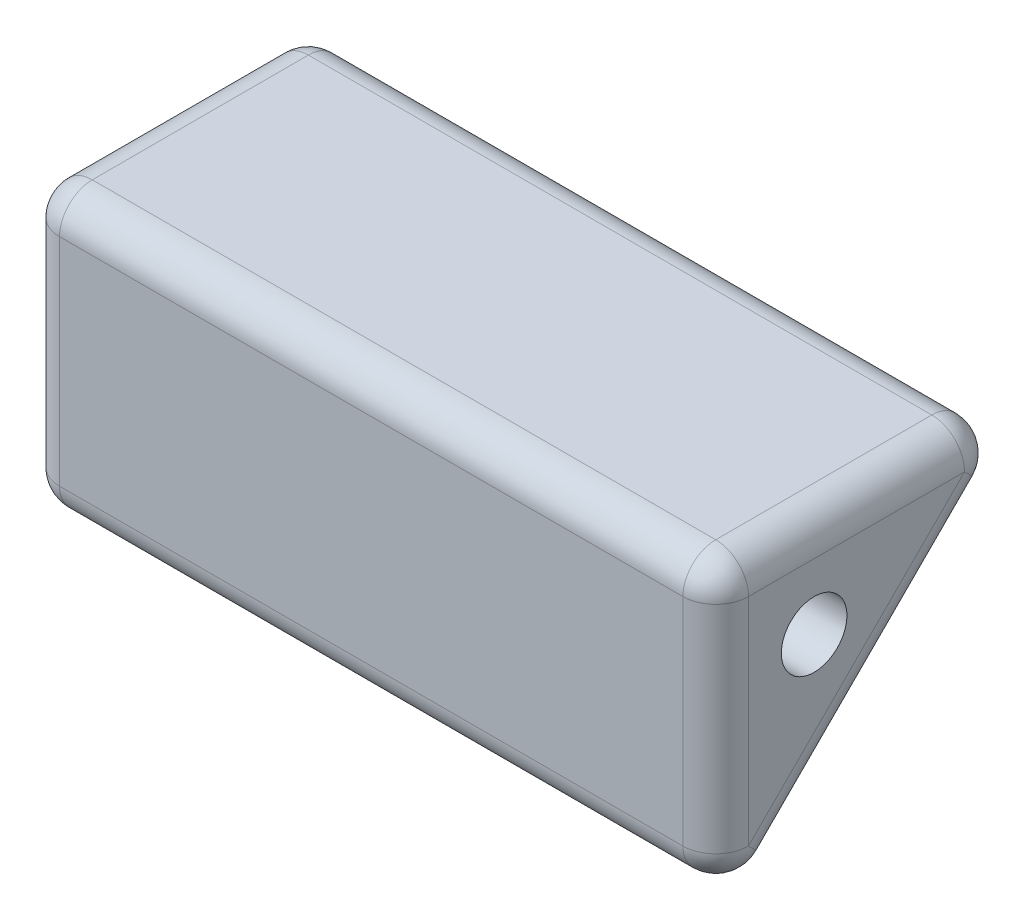
ISO-10303-21;
HEADER;
FILE_DESCRIPTION(('STEP AP214'),'2;1');
FILE_NAME('part.step','',(''),(''),'','','');
FILE_SCHEMA(('AUTOMOTIVE_DESIGN { 1 0 10303 214 1 1 1 1 }'));
ENDSEC;
DATA;
#1=APPLICATION_CONTEXT('core data for automotive mechanical design processes');
#2=APPLICATION_PROTOCOL_DEFINITION('international standard','automotive_design',2000,#1);
#3=PRODUCT_CONTEXT('',#1,'mechanical');
#4=PRODUCT('Part','Part','',(#3));
#5=PRODUCT_RELATED_PRODUCT_CATEGORY('part','',(#4));
#6=PRODUCT_DEFINITION_FORMATION('','',#4);
#7=PRODUCT_DEFINITION_CONTEXT('part definition',#1,'design');
#8=PRODUCT_DEFINITION('design','',#6,#7);
#9=PRODUCT_DEFINITION_SHAPE('','',#8);
#10=(LENGTH_UNIT() NAMED_UNIT(*) SI_UNIT(.MILLI.,.METRE.));
#11=(NAMED_UNIT(*) PLANE_ANGLE_UNIT() SI_UNIT($,.RADIAN.));
#12=(NAMED_UNIT(*) SI_UNIT($,.STERADIAN.) SOLID_ANGLE_UNIT());
#13=UNCERTAINTY_MEASURE_WITH_UNIT(LENGTH_MEASURE(1.E-05),#10,'distance_accuracy_value','');
#14=(GEOMETRIC_REPRESENTATION_CONTEXT(3) GLOBAL_UNCERTAINTY_ASSIGNED_CONTEXT((#13)) GLOBAL_UNIT_ASSIGNED_CONTEXT((#10,
#11,#12)) REPRESENTATION_CONTEXT('',''));
#15=CARTESIAN_POINT('',(0.,0.,0.));
#16=DIRECTION('',(0.,0.,1.));
#17=DIRECTION('',(1.,0.,0.));
#18=AXIS2_PLACEMENT_3D('',#15,#16,#17);
#19=CARTESIAN_POINT('',(21.,0.,0.));
#20=DIRECTION('',(0.,1.,0.));
#21=DIRECTION('',(0.,0.,1.));
#22=AXIS2_PLACEMENT_3D('',#19,#20,#21);
#23=PLANE('',#22);
#24=DIRECTION('',(0.,0.,-1.));
#25=VECTOR('',#24,1.);
#26=CARTESIAN_POINT('',(1.,0.,0.));
#27=LINE('',#26,#25);
#28=CARTESIAN_POINT('',(1.,0.,-7.58578643762691));
#29=VERTEX_POINT('',#28);
#30=CARTESIAN_POINT('',(1.,0.,-1.));
#31=VERTEX_POINT('',#30);
#32=EDGE_CURVE('E147',#29,#31,#27,.F.);
#33=ORIENTED_EDGE('',*,*,#32,.T.);
#34=DIRECTION('',(-1.,0.,0.));
#35=VECTOR('',#34,1.);
#36=CARTESIAN_POINT('',(21.,0.,-1.));
#37=LINE('',#36,#35);
#38=CARTESIAN_POINT('',(20.,0.,-1.));
#39=VERTEX_POINT('',#38);
#40=EDGE_CURVE('E151',#31,#39,#37,.F.);
#41=ORIENTED_EDGE('',*,*,#40,.T.);
#42=DIRECTION('',(0.,0.,-1.));
#43=VECTOR('',#42,1.);
#44=CARTESIAN_POINT('',(20.,0.,0.));
#45=LINE('',#44,#43);
#46=CARTESIAN_POINT('',(20.,0.,-7.58578643762691));
#47=VERTEX_POINT('',#46);
#48=EDGE_CURVE('E121',#39,#47,#45,.T.);
#49=ORIENTED_EDGE('',*,*,#48,.T.);
#50=DIRECTION('',(-1.,0.,0.));
#51=VECTOR('',#50,1.);
#52=CARTESIAN_POINT('',(21.,0.,-7.58578643762691));
#53=LINE('',#52,#51);
#54=EDGE_CURVE('E140',#47,#29,#53,.T.);
#55=ORIENTED_EDGE('',*,*,#54,.T.);
#56=EDGE_LOOP('',(#33,#41,#49,#55));
#57=FACE_BOUND('',#56,.T.);
#58=ADVANCED_FACE('F45',(#57),#23,.T.);
#59=CARTESIAN_POINT('',(21.,0.,0.));
#60=DIRECTION('',(0.,0.,-1.));
#61=DIRECTION('',(0.,1.,0.));
#62=AXIS2_PLACEMENT_3D('',#59,#60,#61);
#63=PLANE('',#62);
#64=DIRECTION('',(0.,-1.,0.));
#65=VECTOR('',#64,1.);
#66=CARTESIAN_POINT('',(20.,0.,0.));
#67=LINE('',#66,#65);
#68=CARTESIAN_POINT('',(20.,-7.5857864376269,0.));
#69=VERTEX_POINT('',#68);
#70=CARTESIAN_POINT('',(20.,-1.,0.));
#71=VERTEX_POINT('',#70);
#72=EDGE_CURVE('E184',#69,#71,#67,.F.);
#73=ORIENTED_EDGE('',*,*,#72,.T.);
#74=DIRECTION('',(-1.,0.,0.));
#75=VECTOR('',#74,1.);
#76=CARTESIAN_POINT('',(0.,-1.,0.));
#77=LINE('',#76,#75);
#78=CARTESIAN_POINT('',(1.,-1.,0.));
#79=VERTEX_POINT('',#78);
#80=EDGE_CURVE('E187',#71,#79,#77,.T.);
#81=ORIENTED_EDGE('',*,*,#80,.T.);
#82=DIRECTION('',(0.,-1.,0.));
#83=VECTOR('',#82,1.);
#84=CARTESIAN_POINT('',(1.,0.,0.));
#85=LINE('',#84,#83);
#86=CARTESIAN_POINT('',(1.,-7.5857864376269,0.));
#87=VERTEX_POINT('',#86);
#88=EDGE_CURVE('E181',#79,#87,#85,.T.);
#89=ORIENTED_EDGE('',*,*,#88,.T.);
#90=DIRECTION('',(-1.,0.,0.));
#91=VECTOR('',#90,1.);
#92=CARTESIAN_POINT('',(21.,-7.5857864376269,0.));
#93=LINE('',#92,#91);
#94=EDGE_CURVE('E178',#87,#69,#93,.F.);
#95=ORIENTED_EDGE('',*,*,#94,.T.);
#96=EDGE_LOOP('',(#73,#81,#89,#95));
#97=FACE_BOUND('',#96,.T.);
#98=ADVANCED_FACE('F284',(#97),#63,.F.);
#99=CARTESIAN_POINT('',(21.,-5.,-5.));
#100=DIRECTION('',(0.,-0.707106781186547,-0.707106781186547));
#101=DIRECTION('',(0.,0.707106781186548,-0.707106781186548));
#102=AXIS2_PLACEMENT_3D('',#99,#100,#101);
#103=PLANE('',#102);
#104=DIRECTION('',(0.,-0.707106781186548,0.707106781186548));
#105=VECTOR('',#104,1.);
#106=CARTESIAN_POINT('',(20.,-5.,-5.));
#107=LINE('',#106,#105);
#108=CARTESIAN_POINT('',(20.,-1.70710678118655,-8.29289321881345));
#109=VERTEX_POINT('',#108);
#110=CARTESIAN_POINT('',(20.,-8.29289321881345,-1.70710678118655));
#111=VERTEX_POINT('',#110);
#112=EDGE_CURVE('E55',#109,#111,#107,.T.);
#113=ORIENTED_EDGE('',*,*,#112,.T.);
#114=DIRECTION('',(-1.,0.,0.));
#115=VECTOR('',#114,1.);
#116=CARTESIAN_POINT('',(0.,-8.29289321881345,-1.70710678118655));
#117=LINE('',#116,#115);
#118=CARTESIAN_POINT('',(1.,-8.29289321881345,-1.70710678118655));
#119=VERTEX_POINT('',#118);
#120=EDGE_CURVE('E11',#111,#119,#117,.T.);
#121=ORIENTED_EDGE('',*,*,#120,.T.);
#122=DIRECTION('',(0.,-0.707106781186548,0.707106781186548));
#123=VECTOR('',#122,1.);
#124=CARTESIAN_POINT('',(1.,0.,-10.));
#125=LINE('',#124,#123);
#126=CARTESIAN_POINT('',(1.,-1.70710678118655,-8.29289321881345));
#127=VERTEX_POINT('',#126);
#128=EDGE_CURVE('E191',#119,#127,#125,.F.);
#129=ORIENTED_EDGE('',*,*,#128,.T.);
#130=DIRECTION('',(-1.,0.,0.));
#131=VECTOR('',#130,1.);
#132=CARTESIAN_POINT('',(21.,-1.70710678118655,-8.29289321881345));
#133=LINE('',#132,#131);
#134=EDGE_CURVE('E66',#127,#109,#133,.F.);
#135=ORIENTED_EDGE('',*,*,#134,.T.);
#136=EDGE_LOOP('',(#113,#121,#129,#135));
#137=FACE_BOUND('',#136,.T.);
#138=ADVANCED_FACE('F289',(#137),#103,.T.);
#139=CARTESIAN_POINT('',(21.,0.,0.));
#140=DIRECTION('',(1.,0.,0.));
#141=DIRECTION('',(0.,0.,-1.));
#142=AXIS2_PLACEMENT_3D('',#139,#140,#141);
#143=PLANE('',#142);
#144=DIRECTION('',(0.,-0.707106781186548,0.707106781186548));
#145=VECTOR('',#144,1.);
#146=CARTESIAN_POINT('',(21.,-4.29289321881345,-4.29289321881345));
#147=LINE('',#146,#145);
#148=CARTESIAN_POINT('',(21.,-7.5857864376269,-1.));
#149=VERTEX_POINT('',#148);
#150=CARTESIAN_POINT('',(21.,-1.,-7.58578643762691));
#151=VERTEX_POINT('',#150);
#152=EDGE_CURVE('E157',#149,#151,#147,.F.);
#153=ORIENTED_EDGE('',*,*,#152,.T.);
#154=DIRECTION('',(0.,0.,-1.));
#155=VECTOR('',#154,1.);
#156=CARTESIAN_POINT('',(21.,-1.,0.));
#157=LINE('',#156,#155);
#158=CARTESIAN_POINT('',(21.,-1.,-1.));
#159=VERTEX_POINT('',#158);
#160=EDGE_CURVE('E123',#151,#159,#157,.F.);
#161=ORIENTED_EDGE('',*,*,#160,.T.);
#162=DIRECTION('',(0.,-1.,0.));
#163=VECTOR('',#162,1.);
#164=CARTESIAN_POINT('',(21.,-10.,-1.));
#165=LINE('',#164,#163);
#166=EDGE_CURVE('E163',#159,#149,#165,.T.);
#167=ORIENTED_EDGE('',*,*,#166,.T.);
#168=EDGE_LOOP('',(#153,#161,#167));
#169=FACE_BOUND('',#168,.T.);
#170=CARTESIAN_POINT('',(21.,-3.,-3.));
#171=DIRECTION('',(-1.,0.,0.));
#172=DIRECTION('',(0.,0.,1.));
#173=AXIS2_PLACEMENT_3D('',#170,#171,#172);
#174=CIRCLE('',#173,1.);
#175=CARTESIAN_POINT('',(21.,-3.,-2.));
#176=VERTEX_POINT('',#175);
#177=EDGE_CURVE('E148',#176,#176,#174,.T.);
#178=ORIENTED_EDGE('',*,*,#177,.T.);
#179=EDGE_LOOP('',(#178));
#180=FACE_BOUND('',#179,.T.);
#181=ADVANCED_FACE('F268',(#169,#180),#143,.T.);
#182=CARTESIAN_POINT('',(0.,0.,0.));
#183=DIRECTION('',(1.,0.,0.));
#184=DIRECTION('',(0.,0.,-1.));
#185=AXIS2_PLACEMENT_3D('',#182,#183,#184);
#186=PLANE('',#185);
#187=DIRECTION('',(0.,-1.,0.));
#188=VECTOR('',#187,1.);
#189=CARTESIAN_POINT('',(0.,0.,-1.));
#190=LINE('',#189,#188);
#191=CARTESIAN_POINT('',(0.,-7.58578643762691,-1.));
#192=VERTEX_POINT('',#191);
#193=CARTESIAN_POINT('',(0.,-1.,-1.));
#194=VERTEX_POINT('',#193);
#195=EDGE_CURVE('E171',#192,#194,#190,.F.);
#196=ORIENTED_EDGE('',*,*,#195,.T.);
#197=DIRECTION('',(0.,0.,-1.));
#198=VECTOR('',#197,1.);
#199=CARTESIAN_POINT('',(0.,-1.,-10.));
#200=LINE('',#199,#198);
#201=CARTESIAN_POINT('',(0.,-1.,-7.58578643762691));
#202=VERTEX_POINT('',#201);
#203=EDGE_CURVE('E174',#194,#202,#200,.T.);
#204=ORIENTED_EDGE('',*,*,#203,.T.);
#205=DIRECTION('',(0.,-0.707106781186548,0.707106781186548));
#206=VECTOR('',#205,1.);
#207=CARTESIAN_POINT('',(0.,-9.29289321881345,0.707106781186548));
#208=LINE('',#207,#206);
#209=EDGE_CURVE('E168',#202,#192,#208,.T.);
#210=ORIENTED_EDGE('',*,*,#209,.T.);
#211=EDGE_LOOP('',(#196,#204,#210));
#212=FACE_BOUND('',#211,.T.);
#213=CARTESIAN_POINT('',(0.,-3.,-3.));
#214=DIRECTION('',(-1.,0.,0.));
#215=DIRECTION('',(0.,0.,1.));
#216=AXIS2_PLACEMENT_3D('',#213,#214,#215);
#217=CIRCLE('',#216,1.);
#218=CARTESIAN_POINT('',(0.,-3.,-2.));
#219=VERTEX_POINT('',#218);
#220=EDGE_CURVE('E253',#219,#219,#217,.T.);
#221=ORIENTED_EDGE('',*,*,#220,.F.);
#222=EDGE_LOOP('',(#221));
#223=FACE_BOUND('',#222,.T.);
#224=ADVANCED_FACE('F272',(#212,#223),#186,.F.);
#225=CARTESIAN_POINT('',(21.,-3.,-3.));
#226=DIRECTION('',(-1.,0.,0.));
#227=DIRECTION('',(0.,0.,1.));
#228=AXIS2_PLACEMENT_3D('',#225,#226,#227);
#229=CYLINDRICAL_SURFACE('',#228,1.);
#230=ORIENTED_EDGE('',*,*,#177,.F.);
#231=EDGE_LOOP('',(#230));
#232=FACE_BOUND('',#231,.T.);
#233=ORIENTED_EDGE('',*,*,#220,.T.);
#234=EDGE_LOOP('',(#233));
#235=FACE_BOUND('',#234,.T.);
#236=ADVANCED_FACE('F270',(#232,#235),#229,.F.);
#237=CARTESIAN_POINT('',(1.,-7.5857864376269,-1.));
#238=DIRECTION('',(-1.,0.,0.));
#239=DIRECTION('',(0.,-1.,0.));
#240=AXIS2_PLACEMENT_3D('',#237,#238,#239);
#241=SPHERICAL_SURFACE('',#240,1.);
#242=CARTESIAN_POINT('',(1.,-7.5857864376269,-1.));
#243=DIRECTION('',(-1.,0.,0.));
#244=DIRECTION('',(0.,0.,1.));
#245=AXIS2_PLACEMENT_3D('',#242,#243,#244);
#246=CIRCLE('',#245,1.);
#247=EDGE_CURVE('E241',#87,#119,#246,.F.);
#248=ORIENTED_EDGE('',*,*,#247,.F.);
#249=CARTESIAN_POINT('',(1.,-7.5857864376269,-1.));
#250=DIRECTION('',(0.,-1.,0.));
#251=DIRECTION('',(1.,0.,0.));
#252=AXIS2_PLACEMENT_3D('',#249,#250,#251);
#253=CIRCLE('',#252,1.);
#254=EDGE_CURVE('E49',#192,#87,#253,.F.);
#255=ORIENTED_EDGE('',*,*,#254,.F.);
#256=CARTESIAN_POINT('',(1.,-7.58578643762691,-1.));
#257=DIRECTION('',(0.,-0.707106781186549,0.707106781186546));
#258=DIRECTION('',(0.,-0.707106781186546,-0.707106781186549));
#259=AXIS2_PLACEMENT_3D('',#256,#257,#258);
#260=CIRCLE('',#259,1.);
#261=EDGE_CURVE('E244',#119,#192,#260,.F.);
#262=ORIENTED_EDGE('',*,*,#261,.F.);
#263=EDGE_LOOP('',(#248,#255,#262));
#264=FACE_BOUND('',#263,.T.);
#265=ADVANCED_FACE('F47',(#264),#241,.T.);
#266=CARTESIAN_POINT('',(1.,0.,-1.));
#267=DIRECTION('',(0.,-1.,0.));
#268=DIRECTION('',(0.,0.,-1.));
#269=AXIS2_PLACEMENT_3D('',#266,#267,#268);
#270=CYLINDRICAL_SURFACE('',#269,1.);
#271=ORIENTED_EDGE('',*,*,#254,.T.);
#272=ORIENTED_EDGE('',*,*,#88,.F.);
#273=CARTESIAN_POINT('',(1.,-1.,-1.));
#274=DIRECTION('',(0.,1.,0.));
#275=DIRECTION('',(0.,0.,1.));
#276=AXIS2_PLACEMENT_3D('',#273,#274,#275);
#277=CIRCLE('',#276,1.);
#278=EDGE_CURVE('E237',#194,#79,#277,.T.);
#279=ORIENTED_EDGE('',*,*,#278,.F.);
#280=ORIENTED_EDGE('',*,*,#195,.F.);
#281=EDGE_LOOP('',(#271,#272,#279,#280));
#282=FACE_BOUND('',#281,.T.);
#283=ADVANCED_FACE('F278',(#282),#270,.T.);
#284=CARTESIAN_POINT('',(1.,-1.,0.));
#285=DIRECTION('',(0.,0.,1.));
#286=DIRECTION('',(1.,0.,0.));
#287=AXIS2_PLACEMENT_3D('',#284,#285,#286);
#288=CYLINDRICAL_SURFACE('',#287,1.);
#289=CARTESIAN_POINT('',(1.,-1.,-7.58578643762691));
#290=DIRECTION('',(0.,0.,-1.));
#291=DIRECTION('',(0.,1.,0.));
#292=AXIS2_PLACEMENT_3D('',#289,#290,#291);
#293=CIRCLE('',#292,1.);
#294=EDGE_CURVE('E229',#202,#29,#293,.T.);
#295=ORIENTED_EDGE('',*,*,#294,.F.);
#296=ORIENTED_EDGE('',*,*,#203,.F.);
#297=CARTESIAN_POINT('',(1.,-1.,-1.));
#298=DIRECTION('',(0.,0.,1.));
#299=DIRECTION('',(1.,0.,0.));
#300=AXIS2_PLACEMENT_3D('',#297,#298,#299);
#301=CIRCLE('',#300,1.);
#302=EDGE_CURVE('E233',#31,#194,#301,.T.);
#303=ORIENTED_EDGE('',*,*,#302,.F.);
#304=ORIENTED_EDGE('',*,*,#32,.F.);
#305=EDGE_LOOP('',(#295,#296,#303,#304));
#306=FACE_BOUND('',#305,.T.);
#307=ADVANCED_FACE('F335',(#306),#288,.T.);
#308=CARTESIAN_POINT('',(1.,-4.29289321881345,-4.29289321881345));
#309=DIRECTION('',(0.,0.707106781186548,-0.707106781186548));
#310=DIRECTION('',(0.,0.707106781186548,0.707106781186548));
#311=AXIS2_PLACEMENT_3D('',#308,#309,#310);
#312=CYLINDRICAL_SURFACE('',#311,1.);
#313=ORIENTED_EDGE('',*,*,#261,.T.);
#314=ORIENTED_EDGE('',*,*,#209,.F.);
#315=CARTESIAN_POINT('',(1.,-1.,-7.58578643762691));
#316=DIRECTION('',(0.,0.707106781186548,-0.707106781186548));
#317=DIRECTION('',(0.,0.707106781186548,0.707106781186548));
#318=AXIS2_PLACEMENT_3D('',#315,#316,#317);
#319=CIRCLE('',#318,1.);
#320=EDGE_CURVE('E226',#127,#202,#319,.T.);
#321=ORIENTED_EDGE('',*,*,#320,.F.);
#322=ORIENTED_EDGE('',*,*,#128,.F.);
#323=EDGE_LOOP('',(#313,#314,#321,#322));
#324=FACE_BOUND('',#323,.T.);
#325=ADVANCED_FACE('F331',(#324),#312,.T.);
#326=CARTESIAN_POINT('',(21.,-7.5857864376269,-1.));
#327=DIRECTION('',(1.,0.,0.));
#328=DIRECTION('',(0.,0.,-1.));
#329=AXIS2_PLACEMENT_3D('',#326,#327,#328);
#330=CYLINDRICAL_SURFACE('',#329,1.);
#331=ORIENTED_EDGE('',*,*,#247,.T.);
#332=ORIENTED_EDGE('',*,*,#120,.F.);
#333=CARTESIAN_POINT('',(20.,-7.5857864376269,-1.));
#334=DIRECTION('',(1.,0.,0.));
#335=DIRECTION('',(0.,0.,-1.));
#336=AXIS2_PLACEMENT_3D('',#333,#334,#335);
#337=CIRCLE('',#336,1.);
#338=EDGE_CURVE('E222',#69,#111,#337,.T.);
#339=ORIENTED_EDGE('',*,*,#338,.F.);
#340=ORIENTED_EDGE('',*,*,#94,.F.);
#341=EDGE_LOOP('',(#331,#332,#339,#340));
#342=FACE_BOUND('',#341,.T.);
#343=ADVANCED_FACE('F327',(#342),#330,.T.);
#344=CARTESIAN_POINT('',(1.,-1.,-1.));
#345=DIRECTION('',(-1.,0.,0.));
#346=DIRECTION('',(0.,0.,1.));
#347=AXIS2_PLACEMENT_3D('',#344,#345,#346);
#348=SPHERICAL_SURFACE('',#347,1.);
#349=ORIENTED_EDGE('',*,*,#302,.T.);
#350=ORIENTED_EDGE('',*,*,#278,.T.);
#351=CARTESIAN_POINT('',(1.,-1.,-1.));
#352=DIRECTION('',(-1.,0.,0.));
#353=DIRECTION('',(0.,-1.,0.));
#354=AXIS2_PLACEMENT_3D('',#351,#352,#353);
#355=CIRCLE('',#354,1.);
#356=EDGE_CURVE('E215',#31,#79,#355,.F.);
#357=ORIENTED_EDGE('',*,*,#356,.F.);
#358=EDGE_LOOP('',(#349,#350,#357));
#359=FACE_BOUND('',#358,.T.);
#360=ADVANCED_FACE('F323',(#359),#348,.T.);
#361=CARTESIAN_POINT('',(1.,-1.,-7.58578643762691));
#362=DIRECTION('',(-1.,0.,0.));
#363=DIRECTION('',(0.,0.,1.));
#364=AXIS2_PLACEMENT_3D('',#361,#362,#363);
#365=SPHERICAL_SURFACE('',#364,1.);
#366=ORIENTED_EDGE('',*,*,#320,.T.);
#367=ORIENTED_EDGE('',*,*,#294,.T.);
#368=CARTESIAN_POINT('',(1.,-1.,-7.58578643762691));
#369=DIRECTION('',(-1.,0.,0.));
#370=DIRECTION('',(0.,0.,1.));
#371=AXIS2_PLACEMENT_3D('',#368,#369,#370);
#372=CIRCLE('',#371,1.);
#373=EDGE_CURVE('E143',#127,#29,#372,.F.);
#374=ORIENTED_EDGE('',*,*,#373,.F.);
#375=EDGE_LOOP('',(#366,#367,#374));
#376=FACE_BOUND('',#375,.T.);
#377=ADVANCED_FACE('F319',(#376),#365,.T.);
#378=CARTESIAN_POINT('',(20.,-7.5857864376269,-1.));
#379=DIRECTION('',(1.,0.,0.));
#380=DIRECTION('',(0.,0.,-1.));
#381=AXIS2_PLACEMENT_3D('',#378,#379,#380);
#382=SPHERICAL_SURFACE('',#381,1.);
#383=CARTESIAN_POINT('',(20.,-7.5857864376269,-1.));
#384=DIRECTION('',(0.,-0.707106781186547,0.707106781186547));
#385=DIRECTION('',(0.,-0.707106781186548,-0.707106781186548));
#386=AXIS2_PLACEMENT_3D('',#383,#384,#385);
#387=CIRCLE('',#386,1.);
#388=EDGE_CURVE('E209',#149,#111,#387,.F.);
#389=ORIENTED_EDGE('',*,*,#388,.F.);
#390=CARTESIAN_POINT('',(20.,-7.5857864376269,-1.));
#391=DIRECTION('',(0.,-1.,0.));
#392=DIRECTION('',(0.,0.,-1.));
#393=AXIS2_PLACEMENT_3D('',#390,#391,#392);
#394=CIRCLE('',#393,1.);
#395=EDGE_CURVE('E218',#69,#149,#394,.F.);
#396=ORIENTED_EDGE('',*,*,#395,.F.);
#397=ORIENTED_EDGE('',*,*,#338,.T.);
#398=EDGE_LOOP('',(#389,#396,#397));
#399=FACE_BOUND('',#398,.T.);
#400=ADVANCED_FACE('F315',(#399),#382,.T.);
#401=CARTESIAN_POINT('',(20.,0.,-1.));
#402=DIRECTION('',(0.,1.,0.));
#403=DIRECTION('',(0.,0.,1.));
#404=AXIS2_PLACEMENT_3D('',#401,#402,#403);
#405=CYLINDRICAL_SURFACE('',#404,1.);
#406=ORIENTED_EDGE('',*,*,#395,.T.);
#407=ORIENTED_EDGE('',*,*,#166,.F.);
#408=CARTESIAN_POINT('',(20.,-1.,-1.));
#409=DIRECTION('',(0.,1.,0.));
#410=DIRECTION('',(0.,0.,1.));
#411=AXIS2_PLACEMENT_3D('',#408,#409,#410);
#412=CIRCLE('',#411,1.);
#413=EDGE_CURVE('E205',#71,#159,#412,.T.);
#414=ORIENTED_EDGE('',*,*,#413,.F.);
#415=ORIENTED_EDGE('',*,*,#72,.F.);
#416=EDGE_LOOP('',(#406,#407,#414,#415));
#417=FACE_BOUND('',#416,.T.);
#418=ADVANCED_FACE('F311',(#417),#405,.T.);
#419=CARTESIAN_POINT('',(21.,-1.,-1.));
#420=DIRECTION('',(1.,0.,0.));
#421=DIRECTION('',(0.,0.,-1.));
#422=AXIS2_PLACEMENT_3D('',#419,#420,#421);
#423=CYLINDRICAL_SURFACE('',#422,1.);
#424=ORIENTED_EDGE('',*,*,#356,.T.);
#425=ORIENTED_EDGE('',*,*,#80,.F.);
#426=CARTESIAN_POINT('',(20.,-1.,-1.));
#427=DIRECTION('',(1.,0.,0.));
#428=DIRECTION('',(0.,0.,-1.));
#429=AXIS2_PLACEMENT_3D('',#426,#427,#428);
#430=CIRCLE('',#429,1.);
#431=EDGE_CURVE('E137',#39,#71,#430,.T.);
#432=ORIENTED_EDGE('',*,*,#431,.F.);
#433=ORIENTED_EDGE('',*,*,#40,.F.);
#434=EDGE_LOOP('',(#424,#425,#432,#433));
#435=FACE_BOUND('',#434,.T.);
#436=ADVANCED_FACE('F308',(#435),#423,.T.);
#437=CARTESIAN_POINT('',(21.,-1.,-7.58578643762691));
#438=DIRECTION('',(-1.,0.,0.));
#439=DIRECTION('',(0.,0.,1.));
#440=AXIS2_PLACEMENT_3D('',#437,#438,#439);
#441=CYLINDRICAL_SURFACE('',#440,1.);
#442=ORIENTED_EDGE('',*,*,#373,.T.);
#443=ORIENTED_EDGE('',*,*,#54,.F.);
#444=CARTESIAN_POINT('',(20.,-1.,-7.58578643762691));
#445=DIRECTION('',(1.,0.,0.));
#446=DIRECTION('',(0.,0.,-1.));
#447=AXIS2_PLACEMENT_3D('',#444,#445,#446);
#448=CIRCLE('',#447,1.);
#449=EDGE_CURVE('E130',#109,#47,#448,.T.);
#450=ORIENTED_EDGE('',*,*,#449,.F.);
#451=ORIENTED_EDGE('',*,*,#134,.F.);
#452=EDGE_LOOP('',(#442,#443,#450,#451));
#453=FACE_BOUND('',#452,.T.);
#454=ADVANCED_FACE('F141',(#453),#441,.T.);
#455=CARTESIAN_POINT('',(20.,-4.29289321881345,-4.29289321881345));
#456=DIRECTION('',(0.,-0.707106781186548,0.707106781186548));
#457=DIRECTION('',(0.,-0.707106781186548,-0.707106781186548));
#458=AXIS2_PLACEMENT_3D('',#455,#456,#457);
#459=CYLINDRICAL_SURFACE('',#458,1.);
#460=ORIENTED_EDGE('',*,*,#388,.T.);
#461=ORIENTED_EDGE('',*,*,#112,.F.);
#462=CARTESIAN_POINT('',(20.,-1.,-7.58578643762691));
#463=DIRECTION('',(0.,0.707106781186547,-0.707106781186548));
#464=DIRECTION('',(0.,0.707106781186548,0.707106781186547));
#465=AXIS2_PLACEMENT_3D('',#462,#463,#464);
#466=CIRCLE('',#465,1.);
#467=EDGE_CURVE('E134',#151,#109,#466,.T.);
#468=ORIENTED_EDGE('',*,*,#467,.F.);
#469=ORIENTED_EDGE('',*,*,#152,.F.);
#470=EDGE_LOOP('',(#460,#461,#468,#469));
#471=FACE_BOUND('',#470,.T.);
#472=ADVANCED_FACE('F301',(#471),#459,.T.);
#473=CARTESIAN_POINT('',(20.,-1.,-1.));
#474=DIRECTION('',(0.,0.,1.));
#475=DIRECTION('',(1.,0.,0.));
#476=AXIS2_PLACEMENT_3D('',#473,#474,#475);
#477=SPHERICAL_SURFACE('',#476,1.);
#478=ORIENTED_EDGE('',*,*,#431,.T.);
#479=ORIENTED_EDGE('',*,*,#413,.T.);
#480=CARTESIAN_POINT('',(20.,-1.,-1.));
#481=DIRECTION('',(0.,0.,1.));
#482=DIRECTION('',(1.,0.,0.));
#483=AXIS2_PLACEMENT_3D('',#480,#481,#482);
#484=CIRCLE('',#483,1.);
#485=EDGE_CURVE('E127',#39,#159,#484,.F.);
#486=ORIENTED_EDGE('',*,*,#485,.F.);
#487=EDGE_LOOP('',(#478,#479,#486));
#488=FACE_BOUND('',#487,.T.);
#489=ADVANCED_FACE('F298',(#488),#477,.T.);
#490=CARTESIAN_POINT('',(20.,-1.,-7.58578643762691));
#491=DIRECTION('',(1.,0.,0.));
#492=DIRECTION('',(0.,0.,-1.));
#493=AXIS2_PLACEMENT_3D('',#490,#491,#492);
#494=SPHERICAL_SURFACE('',#493,1.);
#495=ORIENTED_EDGE('',*,*,#467,.T.);
#496=ORIENTED_EDGE('',*,*,#449,.T.);
#497=CARTESIAN_POINT('',(20.,-1.,-7.58578643762691));
#498=DIRECTION('',(0.,0.,-1.));
#499=DIRECTION('',(-1.,0.,0.));
#500=AXIS2_PLACEMENT_3D('',#497,#498,#499);
#501=CIRCLE('',#500,1.);
#502=EDGE_CURVE('E117',#151,#47,#501,.F.);
#503=ORIENTED_EDGE('',*,*,#502,.F.);
#504=EDGE_LOOP('',(#495,#496,#503));
#505=FACE_BOUND('',#504,.T.);
#506=ADVANCED_FACE('F132',(#505),#494,.T.);
#507=CARTESIAN_POINT('',(20.,-1.,0.));
#508=DIRECTION('',(0.,0.,-1.));
#509=DIRECTION('',(-1.,0.,0.));
#510=AXIS2_PLACEMENT_3D('',#507,#508,#509);
#511=CYLINDRICAL_SURFACE('',#510,1.);
#512=ORIENTED_EDGE('',*,*,#485,.T.);
#513=ORIENTED_EDGE('',*,*,#160,.F.);
#514=ORIENTED_EDGE('',*,*,#502,.T.);
#515=ORIENTED_EDGE('',*,*,#48,.F.);
#516=EDGE_LOOP('',(#512,#513,#514,#515));
#517=FACE_BOUND('',#516,.T.);
#518=ADVANCED_FACE('F119',(#517),#511,.T.);
#519=CLOSED_SHELL('',(#58,#98,#138,#181,#224,#236,#265,#283,#307,#325,#343,#360,#377,#400,#418,
#436,#454,#472,#489,#506,#518));
#520=MANIFOLD_SOLID_BREP('B2',#519);
#521=ADVANCED_BREP_SHAPE_REPRESENTATION('',(#18,#520),#14);
#522=SHAPE_DEFINITION_REPRESENTATION(#9,#521);
ENDSEC;
END-ISO-10303-21;
